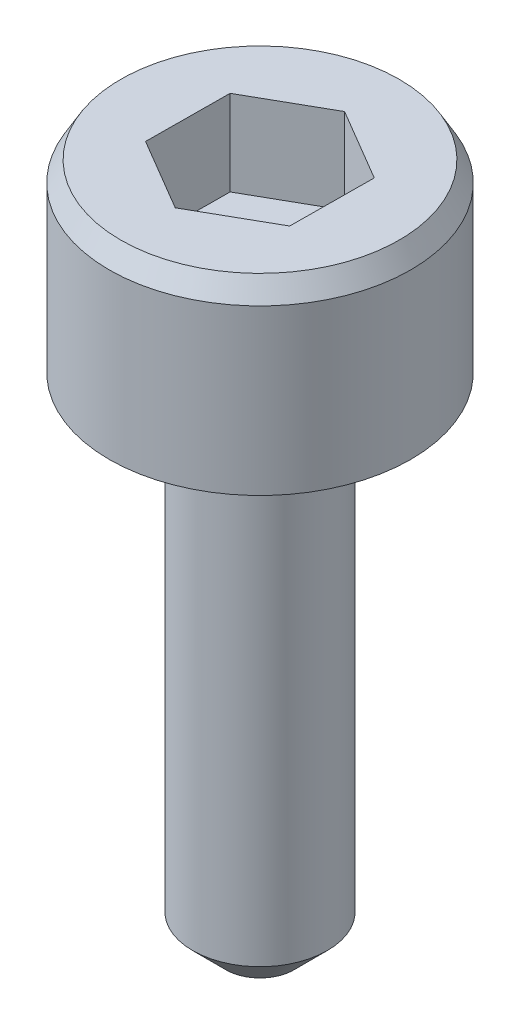
ISO-10303-21;
HEADER;
FILE_DESCRIPTION(('STEP AP214'),'2;1');
FILE_NAME('part.step','',(''),(''),'','','');
FILE_SCHEMA(('AUTOMOTIVE_DESIGN { 1 0 10303 214 1 1 1 1 }'));
ENDSEC;
DATA;
#1=APPLICATION_CONTEXT('core data for automotive mechanical design processes');
#2=APPLICATION_PROTOCOL_DEFINITION('international standard','automotive_design',2000,#1);
#3=PRODUCT_CONTEXT('',#1,'mechanical');
#4=PRODUCT('Part','Part','',(#3));
#5=PRODUCT_RELATED_PRODUCT_CATEGORY('part','',(#4));
#6=PRODUCT_DEFINITION_FORMATION('','',#4);
#7=PRODUCT_DEFINITION_CONTEXT('part definition',#1,'design');
#8=PRODUCT_DEFINITION('design','',#6,#7);
#9=PRODUCT_DEFINITION_SHAPE('','',#8);
#10=(LENGTH_UNIT() NAMED_UNIT(*) SI_UNIT(.MILLI.,.METRE.));
#11=(NAMED_UNIT(*) PLANE_ANGLE_UNIT() SI_UNIT($,.RADIAN.));
#12=(NAMED_UNIT(*) SI_UNIT($,.STERADIAN.) SOLID_ANGLE_UNIT());
#13=UNCERTAINTY_MEASURE_WITH_UNIT(LENGTH_MEASURE(1.E-05),#10,'distance_accuracy_value','');
#14=(GEOMETRIC_REPRESENTATION_CONTEXT(3) GLOBAL_UNCERTAINTY_ASSIGNED_CONTEXT((#13)) GLOBAL_UNIT_ASSIGNED_CONTEXT((#10,
#11,#12)) REPRESENTATION_CONTEXT('',''));
#15=CARTESIAN_POINT('',(0.,0.,0.));
#16=DIRECTION('',(0.,0.,1.));
#17=DIRECTION('',(1.,0.,0.));
#18=AXIS2_PLACEMENT_3D('',#15,#16,#17);
#19=CARTESIAN_POINT('',(7.96166724251823,5.34035,2.75788713518849));
#20=DIRECTION('',(0.,1.,0.));
#21=DIRECTION('',(0.,0.,1.));
#22=AXIS2_PLACEMENT_3D('',#19,#20,#21);
#23=PLANE('',#22);
#24=DIRECTION('',(0.869696466360055,0.,-0.493586928920158));
#25=VECTOR('',#24,1.);
#26=CARTESIAN_POINT('',(7.93666236612716,5.34035,5.95548789328399));
#27=LINE('',#26,#25);
#28=CARTESIAN_POINT('',(7.93666236612716,5.34035,5.95548789328399));
#29=VERTEX_POINT('',#28);
#30=CARTESIAN_POINT('',(9.32614162257197,5.34035,5.16690380042541));
#31=VERTEX_POINT('',#30);
#32=EDGE_CURVE('E65',#29,#31,#27,.T.);
#33=ORIENTED_EDGE('',*,*,#32,.T.);
#34=DIRECTION('',(0.00738941375922408,0.,-0.999972697909445));
#35=VECTOR('',#34,1.);
#36=CARTESIAN_POINT('',(9.32614162257197,5.34035,5.16690380042541));
#37=LINE('',#36,#35);
#38=CARTESIAN_POINT('',(9.33794739335853,5.34035,3.56928741988341));
#39=VERTEX_POINT('',#38);
#40=EDGE_CURVE('E67',#31,#39,#37,.T.);
#41=ORIENTED_EDGE('',*,*,#40,.T.);
#42=DIRECTION('',(-0.861434942879149,0.,-0.507867934788955));
#43=VECTOR('',#42,1.);
#44=CARTESIAN_POINT('',(9.33794739335853,5.34035,3.56928741988341));
#45=LINE('',#44,#43);
#46=CARTESIAN_POINT('',(7.96166724251823,5.34035,2.75788713518849));
#47=VERTEX_POINT('',#46);
#48=EDGE_CURVE('E69',#39,#47,#45,.T.);
#49=ORIENTED_EDGE('',*,*,#48,.T.);
#50=DIRECTION('',(-0.869696466360055,0.,0.493586928920158));
#51=VECTOR('',#50,1.);
#52=CARTESIAN_POINT('',(7.96166724251823,5.34035,2.75788713518849));
#53=LINE('',#52,#51);
#54=CARTESIAN_POINT('',(6.57218798607342,5.34035,3.54647122804707));
#55=VERTEX_POINT('',#54);
#56=EDGE_CURVE('E122',#47,#55,#53,.T.);
#57=ORIENTED_EDGE('',*,*,#56,.T.);
#58=DIRECTION('',(-0.00738941375922392,0.,0.999972697909445));
#59=VECTOR('',#58,1.);
#60=CARTESIAN_POINT('',(6.57218798607342,5.34035,3.54647122804707));
#61=LINE('',#60,#59);
#62=CARTESIAN_POINT('',(6.56038221528686,5.34035,5.14408760858907));
#63=VERTEX_POINT('',#62);
#64=EDGE_CURVE('E127',#55,#63,#61,.T.);
#65=ORIENTED_EDGE('',*,*,#64,.T.);
#66=DIRECTION('',(0.861434942879149,0.,0.507867934788955));
#67=VECTOR('',#66,1.);
#68=CARTESIAN_POINT('',(6.56038221528686,5.34035,5.14408760858907));
#69=LINE('',#68,#67);
#70=EDGE_CURVE('E131',#63,#29,#69,.T.);
#71=ORIENTED_EDGE('',*,*,#70,.T.);
#72=EDGE_LOOP('',(#33,#41,#49,#57,#65,#71));
#73=FACE_BOUND('',#72,.T.);
#74=ADVANCED_FACE('F14',(#73),#23,.T.);
#75=CARTESIAN_POINT('',(9.33794739335853,5.34035,3.56928741988341));
#76=DIRECTION('',(0.507867934788955,0.,-0.861434942879149));
#77=DIRECTION('',(-0.861434942879149,0.,-0.507867934788955));
#78=AXIS2_PLACEMENT_3D('',#75,#76,#77);
#79=PLANE('',#78);
#80=DIRECTION('',(0.,1.,0.));
#81=VECTOR('',#80,1.);
#82=CARTESIAN_POINT('',(7.96166724251823,5.34035,2.75788713518849));
#83=LINE('',#82,#81);
#84=CARTESIAN_POINT('',(7.96166724251823,6.96595,2.75788713518849));
#85=VERTEX_POINT('',#84);
#86=EDGE_CURVE('E80',#85,#47,#83,.F.);
#87=ORIENTED_EDGE('',*,*,#86,.T.);
#88=ORIENTED_EDGE('',*,*,#48,.F.);
#89=DIRECTION('',(0.,1.,0.));
#90=VECTOR('',#89,1.);
#91=CARTESIAN_POINT('',(9.33794739335853,5.34035,3.56928741988341));
#92=LINE('',#91,#90);
#93=CARTESIAN_POINT('',(9.33794739335853,6.96595,3.56928741988341));
#94=VERTEX_POINT('',#93);
#95=EDGE_CURVE('E74',#39,#94,#92,.T.);
#96=ORIENTED_EDGE('',*,*,#95,.T.);
#97=DIRECTION('',(0.861434942879148,0.,0.507867934788955));
#98=VECTOR('',#97,1.);
#99=CARTESIAN_POINT('',(7.96166724251823,6.96595,2.75788713518849));
#100=LINE('',#99,#98);
#101=EDGE_CURVE('E119',#85,#94,#100,.T.);
#102=ORIENTED_EDGE('',*,*,#101,.F.);
#103=EDGE_LOOP('',(#87,#88,#96,#102));
#104=FACE_BOUND('',#103,.T.);
#105=ADVANCED_FACE('F77',(#104),#79,.F.);
#106=CARTESIAN_POINT('',(9.32614162257197,5.34035,5.16690380042541));
#107=DIRECTION('',(0.999972697909445,0.,0.00738941375922408));
#108=DIRECTION('',(0.00738941375922408,0.,-0.999972697909445));
#109=AXIS2_PLACEMENT_3D('',#106,#107,#108);
#110=PLANE('',#109);
#111=ORIENTED_EDGE('',*,*,#95,.F.);
#112=ORIENTED_EDGE('',*,*,#40,.F.);
#113=DIRECTION('',(0.,1.,0.));
#114=VECTOR('',#113,1.);
#115=CARTESIAN_POINT('',(9.32614162257197,5.34035,5.16690380042541));
#116=LINE('',#115,#114);
#117=CARTESIAN_POINT('',(9.32614162257197,6.96595,5.16690380042541));
#118=VERTEX_POINT('',#117);
#119=EDGE_CURVE('E88',#31,#118,#116,.T.);
#120=ORIENTED_EDGE('',*,*,#119,.T.);
#121=DIRECTION('',(-0.00738941375922378,0.,0.999972697909446));
#122=VECTOR('',#121,1.);
#123=CARTESIAN_POINT('',(9.33794739335853,6.96595,3.56928741988341));
#124=LINE('',#123,#122);
#125=EDGE_CURVE('E85',#94,#118,#124,.T.);
#126=ORIENTED_EDGE('',*,*,#125,.F.);
#127=EDGE_LOOP('',(#111,#112,#120,#126));
#128=FACE_BOUND('',#127,.T.);
#129=ADVANCED_FACE('F83',(#128),#110,.F.);
#130=CARTESIAN_POINT('',(7.93666236612716,5.34035,5.95548789328399));
#131=DIRECTION('',(0.493586928920158,0.,0.869696466360055));
#132=DIRECTION('',(0.869696466360055,0.,-0.493586928920158));
#133=AXIS2_PLACEMENT_3D('',#130,#131,#132);
#134=PLANE('',#133);
#135=ORIENTED_EDGE('',*,*,#119,.F.);
#136=ORIENTED_EDGE('',*,*,#32,.F.);
#137=DIRECTION('',(0.,1.,0.));
#138=VECTOR('',#137,1.);
#139=CARTESIAN_POINT('',(7.93666236612716,5.34035,5.95548789328399));
#140=LINE('',#139,#138);
#141=CARTESIAN_POINT('',(7.93666236612716,6.96595,5.95548789328399));
#142=VERTEX_POINT('',#141);
#143=EDGE_CURVE('E129',#29,#142,#140,.T.);
#144=ORIENTED_EDGE('',*,*,#143,.T.);
#145=DIRECTION('',(-0.869696466360055,0.,0.493586928920158));
#146=VECTOR('',#145,1.);
#147=CARTESIAN_POINT('',(9.32614162257197,6.96595,5.16690380042541));
#148=LINE('',#147,#146);
#149=EDGE_CURVE('E115',#118,#142,#148,.T.);
#150=ORIENTED_EDGE('',*,*,#149,.F.);
#151=EDGE_LOOP('',(#135,#136,#144,#150));
#152=FACE_BOUND('',#151,.T.);
#153=ADVANCED_FACE('F134',(#152),#134,.F.);
#154=CARTESIAN_POINT('',(6.56038221528686,5.34035,5.14408760858907));
#155=DIRECTION('',(-0.507867934788955,0.,0.861434942879149));
#156=DIRECTION('',(0.861434942879149,0.,0.507867934788955));
#157=AXIS2_PLACEMENT_3D('',#154,#155,#156);
#158=PLANE('',#157);
#159=ORIENTED_EDGE('',*,*,#143,.F.);
#160=ORIENTED_EDGE('',*,*,#70,.F.);
#161=DIRECTION('',(0.,1.,0.));
#162=VECTOR('',#161,1.);
#163=CARTESIAN_POINT('',(6.56038221528686,5.34035,5.14408760858907));
#164=LINE('',#163,#162);
#165=CARTESIAN_POINT('',(6.56038221528686,6.96595,5.14408760858907));
#166=VERTEX_POINT('',#165);
#167=EDGE_CURVE('E125',#63,#166,#164,.T.);
#168=ORIENTED_EDGE('',*,*,#167,.T.);
#169=DIRECTION('',(-0.861434942879149,0.,-0.507867934788954));
#170=VECTOR('',#169,1.);
#171=CARTESIAN_POINT('',(7.93666236612716,6.96595,5.95548789328399));
#172=LINE('',#171,#170);
#173=EDGE_CURVE('E112',#142,#166,#172,.T.);
#174=ORIENTED_EDGE('',*,*,#173,.F.);
#175=EDGE_LOOP('',(#159,#160,#168,#174));
#176=FACE_BOUND('',#175,.T.);
#177=ADVANCED_FACE('F146',(#176),#158,.F.);
#178=CARTESIAN_POINT('',(6.57218798607342,5.34035,3.54647122804707));
#179=DIRECTION('',(-0.999972697909445,0.,-0.00738941375922392));
#180=DIRECTION('',(-0.00738941375922392,0.,0.999972697909445));
#181=AXIS2_PLACEMENT_3D('',#178,#179,#180);
#182=PLANE('',#181);
#183=ORIENTED_EDGE('',*,*,#167,.F.);
#184=ORIENTED_EDGE('',*,*,#64,.F.);
#185=DIRECTION('',(0.,1.,0.));
#186=VECTOR('',#185,1.);
#187=CARTESIAN_POINT('',(6.57218798607342,5.34035,3.54647122804707));
#188=LINE('',#187,#186);
#189=CARTESIAN_POINT('',(6.57218798607342,6.96595,3.54647122804707));
#190=VERTEX_POINT('',#189);
#191=EDGE_CURVE('E32',#55,#190,#188,.T.);
#192=ORIENTED_EDGE('',*,*,#191,.T.);
#193=DIRECTION('',(0.00738941375922432,0.,-0.999972697909445));
#194=VECTOR('',#193,1.);
#195=CARTESIAN_POINT('',(6.56038221528686,6.96595,5.14408760858907));
#196=LINE('',#195,#194);
#197=EDGE_CURVE('E109',#166,#190,#196,.T.);
#198=ORIENTED_EDGE('',*,*,#197,.F.);
#199=EDGE_LOOP('',(#183,#184,#192,#198));
#200=FACE_BOUND('',#199,.T.);
#201=ADVANCED_FACE('F144',(#200),#182,.F.);
#202=CARTESIAN_POINT('',(7.96166724251823,5.34035,2.75788713518849));
#203=DIRECTION('',(-0.493586928920158,0.,-0.869696466360055));
#204=DIRECTION('',(-0.869696466360055,0.,0.493586928920158));
#205=AXIS2_PLACEMENT_3D('',#202,#203,#204);
#206=PLANE('',#205);
#207=ORIENTED_EDGE('',*,*,#191,.F.);
#208=ORIENTED_EDGE('',*,*,#56,.F.);
#209=ORIENTED_EDGE('',*,*,#86,.F.);
#210=DIRECTION('',(0.869696466360055,0.,-0.493586928920159));
#211=VECTOR('',#210,1.);
#212=CARTESIAN_POINT('',(6.57218798607342,6.96595,3.54647122804707));
#213=LINE('',#212,#211);
#214=EDGE_CURVE('E104',#190,#85,#213,.T.);
#215=ORIENTED_EDGE('',*,*,#214,.F.);
#216=EDGE_LOOP('',(#207,#208,#209,#215));
#217=FACE_BOUND('',#216,.T.);
#218=ADVANCED_FACE('F141',(#217),#206,.F.);
#219=CARTESIAN_POINT('',(7.9502,6.96595,4.3561));
#220=DIRECTION('',(0.,1.,0.));
#221=DIRECTION('',(0.,0.,1.));
#222=AXIS2_PLACEMENT_3D('',#219,#220,#221);
#223=PLANE('',#222);
#224=ORIENTED_EDGE('',*,*,#197,.T.);
#225=ORIENTED_EDGE('',*,*,#214,.T.);
#226=ORIENTED_EDGE('',*,*,#101,.T.);
#227=ORIENTED_EDGE('',*,*,#125,.T.);
#228=ORIENTED_EDGE('',*,*,#149,.T.);
#229=ORIENTED_EDGE('',*,*,#173,.T.);
#230=EDGE_LOOP('',(#224,#225,#226,#227,#228,#229));
#231=FACE_BOUND('',#230,.T.);
#232=CARTESIAN_POINT('',(7.9502,6.96595000005118,4.3561));
#233=DIRECTION('',(0.,-1.,0.));
#234=DIRECTION('',(0.,0.,-1.));
#235=AXIS2_PLACEMENT_3D('',#232,#233,#234);
#236=CIRCLE('',#235,2.6502295473782);
#237=CARTESIAN_POINT('',(7.9502,6.96595000005118,1.7058704526218));
#238=VERTEX_POINT('',#237);
#239=EDGE_CURVE('E17',#238,#238,#236,.T.);
#240=ORIENTED_EDGE('',*,*,#239,.F.);
#241=EDGE_LOOP('',(#240));
#242=FACE_BOUND('',#241,.T.);
#243=ADVANCED_FACE('F138',(#231,#242),#223,.T.);
#244=CARTESIAN_POINT('',(7.9502,6.5849500002173,4.3561));
#245=DIRECTION('',(0.,-1.,0.));
#246=DIRECTION('',(0.,0.,-1.));
#247=AXIS2_PLACEMENT_3D('',#244,#245,#246);
#248=CONICAL_SURFACE('',#247,2.87019999986379,0.52359877563817);
#249=CARTESIAN_POINT('',(7.9502,6.58495,4.3561));
#250=DIRECTION('',(0.,1.,0.));
#251=DIRECTION('',(0.,0.,1.));
#252=AXIS2_PLACEMENT_3D('',#249,#250,#251);
#253=CIRCLE('',#252,2.8702);
#254=CARTESIAN_POINT('',(7.9502,6.58495,7.2263));
#255=VERTEX_POINT('',#254);
#256=EDGE_CURVE('E96',#255,#255,#253,.F.);
#257=ORIENTED_EDGE('',*,*,#256,.F.);
#258=EDGE_LOOP('',(#257));
#259=FACE_BOUND('',#258,.T.);
#260=ORIENTED_EDGE('',*,*,#239,.T.);
#261=EDGE_LOOP('',(#260));
#262=FACE_BOUND('',#261,.T.);
#263=ADVANCED_FACE('F179',(#259,#262),#248,.T.);
#264=CARTESIAN_POINT('',(7.9502,-6.06425,4.3561));
#265=DIRECTION('',(0.,1.,0.));
#266=DIRECTION('',(0.,0.,1.));
#267=AXIS2_PLACEMENT_3D('',#264,#265,#266);
#268=PLANE('',#267);
#269=CARTESIAN_POINT('',(7.9502,-6.06425000000854,4.3561));
#270=DIRECTION('',(0.,1.,0.));
#271=DIRECTION('',(0.,0.,1.));
#272=AXIS2_PLACEMENT_3D('',#269,#270,#271);
#273=CIRCLE('',#272,0.645159999952875);
#274=CARTESIAN_POINT('',(7.9502,-6.06425000000854,5.00125999995288));
#275=VERTEX_POINT('',#274);
#276=EDGE_CURVE('E94',#275,#275,#273,.T.);
#277=ORIENTED_EDGE('',*,*,#276,.F.);
#278=EDGE_LOOP('',(#277));
#279=FACE_BOUND('',#278,.T.);
#280=ADVANCED_FACE('F175',(#279),#268,.F.);
#281=CARTESIAN_POINT('',(7.9502,6.96595,4.3561));
#282=DIRECTION('',(0.,1.,0.));
#283=DIRECTION('',(0.,0.,1.));
#284=AXIS2_PLACEMENT_3D('',#281,#282,#283);
#285=CYLINDRICAL_SURFACE('',#284,2.8702);
#286=CARTESIAN_POINT('',(7.9502,3.46075,4.3561));
#287=DIRECTION('',(0.,1.,0.));
#288=DIRECTION('',(0.,0.,1.));
#289=AXIS2_PLACEMENT_3D('',#286,#287,#288);
#290=CIRCLE('',#289,2.8702);
#291=CARTESIAN_POINT('',(7.9502,3.46075,7.2263));
#292=VERTEX_POINT('',#291);
#293=EDGE_CURVE('E92',#292,#292,#290,.T.);
#294=ORIENTED_EDGE('',*,*,#293,.T.);
#295=EDGE_LOOP('',(#294));
#296=FACE_BOUND('',#295,.T.);
#297=ORIENTED_EDGE('',*,*,#256,.T.);
#298=EDGE_LOOP('',(#297));
#299=FACE_BOUND('',#298,.T.);
#300=ADVANCED_FACE('F172',(#296,#299),#285,.T.);
#301=CARTESIAN_POINT('',(7.9502,-5.42925000002015,4.3561));
#302=DIRECTION('',(0.,1.,0.));
#303=DIRECTION('',(0.,0.,1.));
#304=AXIS2_PLACEMENT_3D('',#301,#302,#303);
#305=CONICAL_SURFACE('',#304,1.28015999992097,0.78539816338146);
#306=ORIENTED_EDGE('',*,*,#276,.T.);
#307=EDGE_LOOP('',(#306));
#308=FACE_BOUND('',#307,.T.);
#309=CARTESIAN_POINT('',(7.9502,-5.42924999999999,4.3561));
#310=DIRECTION('',(0.,-1.,0.));
#311=DIRECTION('',(0.,0.,-1.));
#312=AXIS2_PLACEMENT_3D('',#309,#310,#311);
#313=CIRCLE('',#312,1.28016);
#314=CARTESIAN_POINT('',(7.9502,-5.42924999999999,3.07594));
#315=VERTEX_POINT('',#314);
#316=EDGE_CURVE('E23',#315,#315,#313,.F.);
#317=ORIENTED_EDGE('',*,*,#316,.F.);
#318=EDGE_LOOP('',(#317));
#319=FACE_BOUND('',#318,.T.);
#320=ADVANCED_FACE('F164',(#308,#319),#305,.T.);
#321=CARTESIAN_POINT('',(7.9502,3.46075,4.3561));
#322=DIRECTION('',(0.,1.,0.));
#323=DIRECTION('',(0.,0.,1.));
#324=AXIS2_PLACEMENT_3D('',#321,#322,#323);
#325=PLANE('',#324);
#326=CARTESIAN_POINT('',(7.9502,3.46075,4.3561));
#327=DIRECTION('',(0.,-1.,0.));
#328=DIRECTION('',(0.,0.,-1.));
#329=AXIS2_PLACEMENT_3D('',#326,#327,#328);
#330=CIRCLE('',#329,1.28016);
#331=CARTESIAN_POINT('',(7.9502,3.46075,3.07594));
#332=VERTEX_POINT('',#331);
#333=EDGE_CURVE('E9',#332,#332,#330,.T.);
#334=ORIENTED_EDGE('',*,*,#333,.F.);
#335=EDGE_LOOP('',(#334));
#336=FACE_BOUND('',#335,.T.);
#337=ORIENTED_EDGE('',*,*,#293,.F.);
#338=EDGE_LOOP('',(#337));
#339=FACE_BOUND('',#338,.T.);
#340=ADVANCED_FACE('F158',(#336,#339),#325,.F.);
#341=CARTESIAN_POINT('',(7.9502,-6.06425,4.3561));
#342=DIRECTION('',(0.,-1.,0.));
#343=DIRECTION('',(0.,0.,-1.));
#344=AXIS2_PLACEMENT_3D('',#341,#342,#343);
#345=CYLINDRICAL_SURFACE('',#344,1.28016);
#346=ORIENTED_EDGE('',*,*,#316,.T.);
#347=EDGE_LOOP('',(#346));
#348=FACE_BOUND('',#347,.T.);
#349=ORIENTED_EDGE('',*,*,#333,.T.);
#350=EDGE_LOOP('',(#349));
#351=FACE_BOUND('',#350,.T.);
#352=ADVANCED_FACE('F156',(#348,#351),#345,.T.);
#353=CLOSED_SHELL('',(#74,#105,#129,#153,#177,#201,#218,#243,#263,#280,#300,#320,#340,#352));
#354=MANIFOLD_SOLID_BREP('B1',#353);
#355=ADVANCED_BREP_SHAPE_REPRESENTATION('',(#18,#354),#14);
#356=SHAPE_DEFINITION_REPRESENTATION(#9,#355);
ENDSEC;
END-ISO-10303-21;
